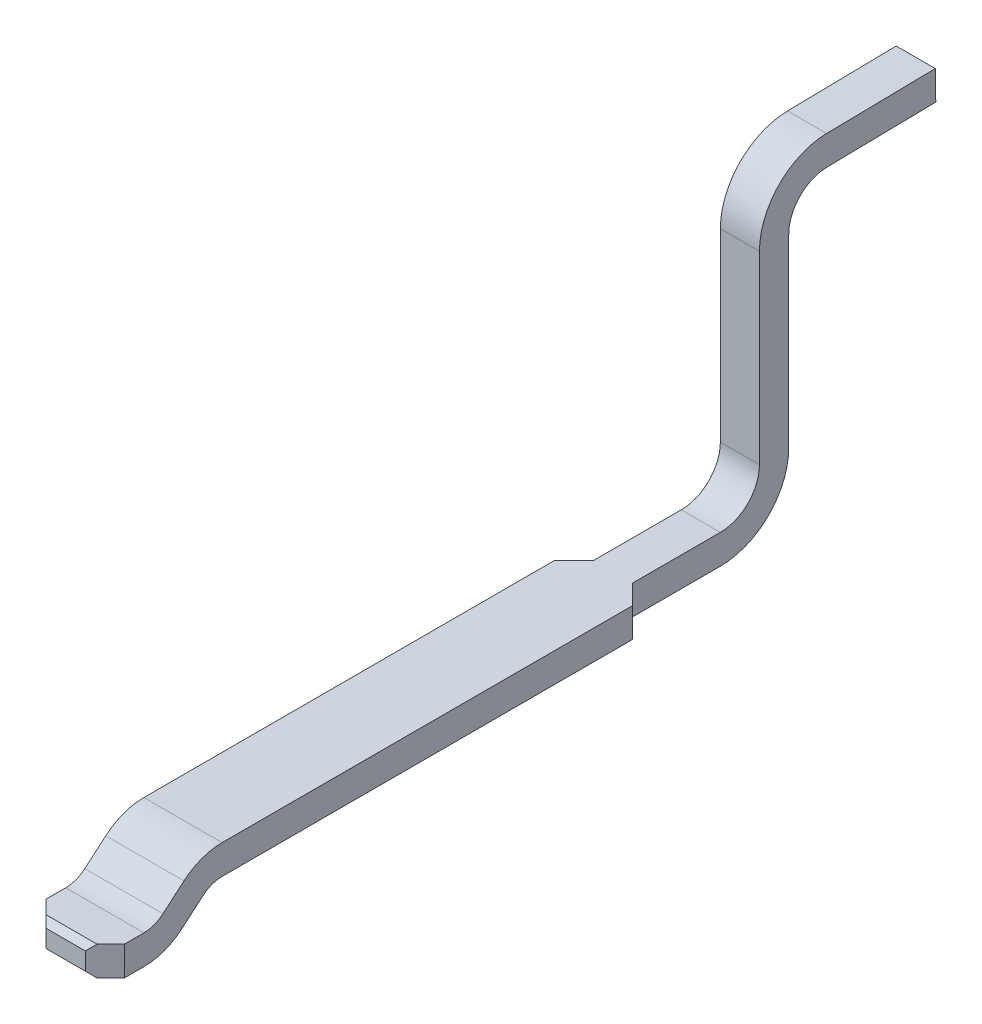
ISO-10303-21;
HEADER;
FILE_DESCRIPTION(('STEP AP214'),'2;1');
FILE_NAME('part.step','',(''),(''),'','','');
FILE_SCHEMA(('AUTOMOTIVE_DESIGN { 1 0 10303 214 1 1 1 1 }'));
ENDSEC;
DATA;
#1=APPLICATION_CONTEXT('core data for automotive mechanical design processes');
#2=APPLICATION_PROTOCOL_DEFINITION('international standard','automotive_design',2000,#1);
#3=PRODUCT_CONTEXT('',#1,'mechanical');
#4=PRODUCT('Part','Part','',(#3));
#5=PRODUCT_RELATED_PRODUCT_CATEGORY('part','',(#4));
#6=PRODUCT_DEFINITION_FORMATION('','',#4);
#7=PRODUCT_DEFINITION_CONTEXT('part definition',#1,'design');
#8=PRODUCT_DEFINITION('design','',#6,#7);
#9=PRODUCT_DEFINITION_SHAPE('','',#8);
#10=(LENGTH_UNIT() NAMED_UNIT(*) SI_UNIT(.MILLI.,.METRE.));
#11=(NAMED_UNIT(*) PLANE_ANGLE_UNIT() SI_UNIT($,.RADIAN.));
#12=(NAMED_UNIT(*) SI_UNIT($,.STERADIAN.) SOLID_ANGLE_UNIT());
#13=UNCERTAINTY_MEASURE_WITH_UNIT(LENGTH_MEASURE(1.E-05),#10,'distance_accuracy_value','');
#14=(GEOMETRIC_REPRESENTATION_CONTEXT(3) GLOBAL_UNCERTAINTY_ASSIGNED_CONTEXT((#13)) GLOBAL_UNIT_ASSIGNED_CONTEXT((#10,
#11,#12)) REPRESENTATION_CONTEXT('',''));
#15=CARTESIAN_POINT('',(0.,0.,0.));
#16=DIRECTION('',(0.,0.,1.));
#17=DIRECTION('',(1.,0.,0.));
#18=AXIS2_PLACEMENT_3D('',#15,#16,#17);
#19=CARTESIAN_POINT('',(-3.54596503503213,8.074228109921,4.324047830079));
#20=DIRECTION('',(0.,0.707106781186548,0.707106781186548));
#21=DIRECTION('',(0.,-0.707106781186548,0.707106781186548));
#22=AXIS2_PLACEMENT_3D('',#19,#20,#21);
#23=PLANE('',#22);
#24=DIRECTION('',(-0.577350269189631,0.577350269189615,-0.577350269189631));
#25=VECTOR('',#24,1.);
#26=CARTESIAN_POINT('',(-3.51026690000013,8.04019892,4.35807702));
#27=LINE('',#26,#25);
#28=CARTESIAN_POINT('',(-3.51026690000013,8.04019892,4.35807702));
#29=VERTEX_POINT('',#28);
#30=CARTESIAN_POINT('',(-3.54026690000013,8.07019892,4.32807702));
#31=VERTEX_POINT('',#30);
#32=EDGE_CURVE('E279',#29,#31,#27,.T.);
#33=ORIENTED_EDGE('',*,*,#32,.F.);
#34=DIRECTION('',(-1.,0.,0.));
#35=VECTOR('',#34,1.);
#36=CARTESIAN_POINT('',(-3.30456876496813,8.04019892,4.35807702));
#37=LINE('',#36,#35);
#38=CARTESIAN_POINT('',(-3.31026690000013,8.04019892,4.35807702));
#39=VERTEX_POINT('',#38);
#40=EDGE_CURVE('E356',#29,#39,#37,.F.);
#41=ORIENTED_EDGE('',*,*,#40,.T.);
#42=DIRECTION('',(-0.577350269189637,-0.577350269189604,0.577350269189637));
#43=VECTOR('',#42,1.);
#44=CARTESIAN_POINT('',(-3.28026690000013,8.07019892,4.32807702));
#45=LINE('',#44,#43);
#46=CARTESIAN_POINT('',(-3.28026690000013,8.07019892,4.32807702));
#47=VERTEX_POINT('',#46);
#48=EDGE_CURVE('E269',#47,#39,#45,.T.);
#49=ORIENTED_EDGE('',*,*,#48,.F.);
#50=DIRECTION('',(1.,0.,0.));
#51=VECTOR('',#50,1.);
#52=CARTESIAN_POINT('',(-3.20226690000013,8.07019892,4.32807702));
#53=LINE('',#52,#51);
#54=EDGE_CURVE('E276',#31,#47,#53,.T.);
#55=ORIENTED_EDGE('',*,*,#54,.F.);
#56=EDGE_LOOP('',(#33,#41,#49,#55));
#57=FACE_BOUND('',#56,.T.);
#58=ADVANCED_FACE('F17',(#57),#23,.T.);
#59=CARTESIAN_POINT('',(-3.30456876496813,7.944500784968,4.35807702));
#60=DIRECTION('',(0.,0.,-1.));
#61=DIRECTION('',(-1.,0.,0.));
#62=AXIS2_PLACEMENT_3D('',#59,#60,#61);
#63=PLANE('',#62);
#64=DIRECTION('',(0.,1.,0.));
#65=VECTOR('',#64,1.);
#66=CARTESIAN_POINT('',(-3.31026690000013,7.914500784968,4.35807702));
#67=LINE('',#66,#65);
#68=CARTESIAN_POINT('',(-3.31026690000013,7.95019892,4.35807702));
#69=VERTEX_POINT('',#68);
#70=EDGE_CURVE('E256',#39,#69,#67,.F.);
#71=ORIENTED_EDGE('',*,*,#70,.F.);
#72=ORIENTED_EDGE('',*,*,#40,.F.);
#73=DIRECTION('',(0.,1.,0.));
#74=VECTOR('',#73,1.);
#75=CARTESIAN_POINT('',(-3.51026690000013,7.914500784968,4.35807702));
#76=LINE('',#75,#74);
#77=CARTESIAN_POINT('',(-3.51026690000013,7.95019892,4.35807702));
#78=VERTEX_POINT('',#77);
#79=EDGE_CURVE('E338',#78,#29,#76,.T.);
#80=ORIENTED_EDGE('',*,*,#79,.F.);
#81=DIRECTION('',(1.,0.,0.));
#82=VECTOR('',#81,1.);
#83=CARTESIAN_POINT('',(-3.27456876496813,7.95019892,4.35807702));
#84=LINE('',#83,#82);
#85=EDGE_CURVE('E331',#69,#78,#84,.F.);
#86=ORIENTED_EDGE('',*,*,#85,.F.);
#87=EDGE_LOOP('',(#71,#72,#80,#86));
#88=FACE_BOUND('',#87,.T.);
#89=ADVANCED_FACE('F775',(#88),#63,.F.);
#90=CARTESIAN_POINT('',(-3.27456876496813,7.916169730079,4.324047830079));
#91=DIRECTION('',(0.,-0.707106781186548,0.707106781186548));
#92=DIRECTION('',(0.,-0.707106781186548,-0.707106781186548));
#93=AXIS2_PLACEMENT_3D('',#90,#91,#92);
#94=PLANE('',#93);
#95=DIRECTION('',(0.577350269189626,-0.577350269189626,-0.577350269189626));
#96=VECTOR('',#95,1.);
#97=CARTESIAN_POINT('',(-3.31026690000013,7.95019892,4.35807702));
#98=LINE('',#97,#96);
#99=CARTESIAN_POINT('',(-3.28026690000013,7.92019892,4.32807702));
#100=VERTEX_POINT('',#99);
#101=EDGE_CURVE('E270',#69,#100,#98,.T.);
#102=ORIENTED_EDGE('',*,*,#101,.F.);
#103=ORIENTED_EDGE('',*,*,#85,.T.);
#104=DIRECTION('',(0.57735026918962,0.577350269189637,0.57735026918962));
#105=VECTOR('',#104,1.);
#106=CARTESIAN_POINT('',(-3.54026690000013,7.92019892,4.32807702));
#107=LINE('',#106,#105);
#108=CARTESIAN_POINT('',(-3.54026690000013,7.92019892,4.32807702));
#109=VERTEX_POINT('',#108);
#110=EDGE_CURVE('E309',#109,#78,#107,.T.);
#111=ORIENTED_EDGE('',*,*,#110,.F.);
#112=DIRECTION('',(1.,0.,0.));
#113=VECTOR('',#112,1.);
#114=CARTESIAN_POINT('',(-3.20226690000013,7.92019892,4.32807702));
#115=LINE('',#114,#113);
#116=EDGE_CURVE('E252',#109,#100,#115,.T.);
#117=ORIENTED_EDGE('',*,*,#116,.T.);
#118=EDGE_LOOP('',(#102,#103,#111,#117));
#119=FACE_BOUND('',#118,.T.);
#120=ADVANCED_FACE('F768',(#119),#94,.T.);
#121=CARTESIAN_POINT('',(-3.30456876496813,8.45127780084181,0.758077020000001));
#122=DIRECTION('',(0.,0.,-1.));
#123=DIRECTION('',(-1.,0.,0.));
#124=AXIS2_PLACEMENT_3D('',#121,#122,#123);
#125=PLANE('',#124);
#126=DIRECTION('',(0.,1.,0.));
#127=VECTOR('',#126,1.);
#128=CARTESIAN_POINT('',(-3.31026690000013,9.610333059471,0.758077020000001));
#129=LINE('',#128,#127);
#130=CARTESIAN_POINT('',(-3.31026690000013,8.47019892,0.758077020000001));
#131=VERTEX_POINT('',#130);
#132=CARTESIAN_POINT('',(-3.31026690000013,9.41625487791,0.758077020000001));
#133=VERTEX_POINT('',#132);
#134=EDGE_CURVE('E416',#131,#133,#129,.T.);
#135=ORIENTED_EDGE('',*,*,#134,.F.);
#136=DIRECTION('',(-1.,0.,0.));
#137=VECTOR('',#136,1.);
#138=CARTESIAN_POINT('',(-3.31026690000013,8.47019892,0.75807702));
#139=LINE('',#138,#137);
#140=CARTESIAN_POINT('',(-3.51026690000013,8.47019892,0.758077020000001));
#141=VERTEX_POINT('',#140);
#142=EDGE_CURVE('E213',#141,#131,#139,.F.);
#143=ORIENTED_EDGE('',*,*,#142,.F.);
#144=DIRECTION('',(0.,1.,0.));
#145=VECTOR('',#144,1.);
#146=CARTESIAN_POINT('',(-3.51026690000013,8.45127780084181,0.758077020000001));
#147=LINE('',#146,#145);
#148=CARTESIAN_POINT('',(-3.51026690000013,9.41625487791,0.758077020000001));
#149=VERTEX_POINT('',#148);
#150=EDGE_CURVE('E412',#149,#141,#147,.F.);
#151=ORIENTED_EDGE('',*,*,#150,.F.);
#152=DIRECTION('',(1.,0.,0.));
#153=VECTOR('',#152,1.);
#154=CARTESIAN_POINT('',(-3.51026690000013,9.41625487791,0.758077020000001));
#155=LINE('',#154,#153);
#156=EDGE_CURVE('E306',#149,#133,#155,.T.);
#157=ORIENTED_EDGE('',*,*,#156,.T.);
#158=EDGE_LOOP('',(#135,#143,#151,#157));
#159=FACE_BOUND('',#158,.T.);
#160=ADVANCED_FACE('F579',(#159),#125,.T.);
#161=CARTESIAN_POINT('',(-3.31026690000013,8.47019892,1.10807702));
#162=DIRECTION('',(-1.,0.,0.));
#163=DIRECTION('',(0.,0.,1.));
#164=AXIS2_PLACEMENT_3D('',#161,#162,#163);
#165=CYLINDRICAL_SURFACE('',#164,0.35);
#166=DIRECTION('',(1.,0.,0.));
#167=VECTOR('',#166,1.);
#168=CARTESIAN_POINT('',(-3.20226690000013,8.12019892,1.10807702));
#169=LINE('',#168,#167);
#170=CARTESIAN_POINT('',(-3.31026690000013,8.12019892,1.10807702));
#171=VERTEX_POINT('',#170);
#172=CARTESIAN_POINT('',(-3.51026690000013,8.12019892,1.10807702));
#173=VERTEX_POINT('',#172);
#174=EDGE_CURVE('E229',#171,#173,#169,.F.);
#175=ORIENTED_EDGE('',*,*,#174,.T.);
#176=CARTESIAN_POINT('',(-3.51026690000013,8.47019892,1.10807702));
#177=DIRECTION('',(-1.,0.,0.));
#178=DIRECTION('',(0.,0.,1.));
#179=AXIS2_PLACEMENT_3D('',#176,#177,#178);
#180=CIRCLE('',#179,0.35);
#181=EDGE_CURVE('E409',#141,#173,#180,.T.);
#182=ORIENTED_EDGE('',*,*,#181,.F.);
#183=ORIENTED_EDGE('',*,*,#142,.T.);
#184=CARTESIAN_POINT('',(-3.31026690000013,8.47019892,1.10807702));
#185=DIRECTION('',(-1.,0.,0.));
#186=DIRECTION('',(0.,0.,1.));
#187=AXIS2_PLACEMENT_3D('',#184,#185,#186);
#188=CIRCLE('',#187,0.35);
#189=EDGE_CURVE('E417',#171,#131,#188,.F.);
#190=ORIENTED_EDGE('',*,*,#189,.F.);
#191=EDGE_LOOP('',(#175,#182,#183,#190));
#192=FACE_BOUND('',#191,.T.);
#193=ADVANCED_FACE('F576',(#192),#165,.T.);
#194=CARTESIAN_POINT('',(-3.30456876496813,8.45127780084181,0.908077020000001));
#195=DIRECTION('',(0.,0.,-1.));
#196=DIRECTION('',(-1.,0.,0.));
#197=AXIS2_PLACEMENT_3D('',#194,#195,#196);
#198=PLANE('',#197);
#199=DIRECTION('',(-1.,0.,0.));
#200=VECTOR('',#199,1.);
#201=CARTESIAN_POINT('',(-3.31026690000013,8.47019892,0.90807702));
#202=LINE('',#201,#200);
#203=CARTESIAN_POINT('',(-3.51026690000013,8.47019892,0.908077020000001));
#204=VERTEX_POINT('',#203);
#205=CARTESIAN_POINT('',(-3.31026690000013,8.47019892,0.908077020000001));
#206=VERTEX_POINT('',#205);
#207=EDGE_CURVE('E218',#204,#206,#202,.F.);
#208=ORIENTED_EDGE('',*,*,#207,.T.);
#209=DIRECTION('',(0.,1.,0.));
#210=VECTOR('',#209,1.);
#211=CARTESIAN_POINT('',(-3.31026690000013,9.610333059471,0.908077020000001));
#212=LINE('',#211,#210);
#213=CARTESIAN_POINT('',(-3.31026690000013,9.41625487791,0.908077020000001));
#214=VERTEX_POINT('',#213);
#215=EDGE_CURVE('E216',#214,#206,#212,.F.);
#216=ORIENTED_EDGE('',*,*,#215,.F.);
#217=DIRECTION('',(1.,0.,0.));
#218=VECTOR('',#217,1.);
#219=CARTESIAN_POINT('',(-3.51026690000013,9.41625487791,0.908077020000001));
#220=LINE('',#219,#218);
#221=CARTESIAN_POINT('',(-3.51026690000013,9.41625487791,0.908077020000001));
#222=VERTEX_POINT('',#221);
#223=EDGE_CURVE('E203',#222,#214,#220,.T.);
#224=ORIENTED_EDGE('',*,*,#223,.F.);
#225=DIRECTION('',(0.,1.,0.));
#226=VECTOR('',#225,1.);
#227=CARTESIAN_POINT('',(-3.51026690000013,8.45127780084181,0.908077020000001));
#228=LINE('',#227,#226);
#229=EDGE_CURVE('E404',#204,#222,#228,.T.);
#230=ORIENTED_EDGE('',*,*,#229,.F.);
#231=EDGE_LOOP('',(#208,#216,#224,#230));
#232=FACE_BOUND('',#231,.T.);
#233=ADVANCED_FACE('F217',(#232),#198,.F.);
#234=CARTESIAN_POINT('',(-3.51026690000013,9.41625487791,0.558077020000001));
#235=DIRECTION('',(1.,0.,0.));
#236=DIRECTION('',(0.,0.,-1.));
#237=AXIS2_PLACEMENT_3D('',#234,#235,#236);
#238=CYLINDRICAL_SURFACE('',#237,0.35);
#239=ORIENTED_EDGE('',*,*,#223,.T.);
#240=CARTESIAN_POINT('',(-3.31026690000013,9.41625487791,0.558077020000001));
#241=DIRECTION('',(1.,0.,0.));
#242=DIRECTION('',(0.,0.,-1.));
#243=AXIS2_PLACEMENT_3D('',#240,#241,#242);
#244=CIRCLE('',#243,0.35);
#245=CARTESIAN_POINT('',(-3.31026690000013,9.76620157121429,0.564185362253241));
#246=VERTEX_POINT('',#245);
#247=EDGE_CURVE('E20',#246,#214,#244,.T.);
#248=ORIENTED_EDGE('',*,*,#247,.F.);
#249=DIRECTION('',(1.,0.,0.));
#250=VECTOR('',#249,1.);
#251=CARTESIAN_POINT('',(-3.51596503503213,9.76620157121458,0.564185362253011));
#252=LINE('',#251,#250);
#253=CARTESIAN_POINT('',(-3.51026690000013,9.76620157121429,0.564185362253241));
#254=VERTEX_POINT('',#253);
#255=EDGE_CURVE('E198',#254,#246,#252,.T.);
#256=ORIENTED_EDGE('',*,*,#255,.F.);
#257=CARTESIAN_POINT('',(-3.51026690000013,9.41625487791,0.558077020000001));
#258=DIRECTION('',(1.,0.,0.));
#259=DIRECTION('',(0.,0.,-1.));
#260=AXIS2_PLACEMENT_3D('',#257,#258,#259);
#261=CIRCLE('',#260,0.35);
#262=EDGE_CURVE('E209',#222,#254,#261,.F.);
#263=ORIENTED_EDGE('',*,*,#262,.F.);
#264=EDGE_LOOP('',(#239,#248,#256,#263));
#265=FACE_BOUND('',#264,.T.);
#266=ADVANCED_FACE('F205',(#265),#238,.T.);
#267=CARTESIAN_POINT('',(-3.51596503503213,9.766007480923,0.575304787611001));
#268=DIRECTION('',(0.,0.999847695156406,0.0174524064364471));
#269=DIRECTION('',(0.,-0.0174524064364471,0.999847695156406));
#270=AXIS2_PLACEMENT_3D('',#267,#268,#269);
#271=PLANE('',#270);
#272=DIRECTION('',(0.,0.0174524064385203,-0.99984769515637));
#273=VECTOR('',#272,1.);
#274=CARTESIAN_POINT('',(-3.51026690000013,9.766201571214,0.564185362253001));
#275=LINE('',#274,#273);
#276=CARTESIAN_POINT('',(-3.51026690000013,9.775906085794,0.00821409435916126));
#277=VERTEX_POINT('',#276);
#278=EDGE_CURVE('E318',#254,#277,#275,.T.);
#279=ORIENTED_EDGE('',*,*,#278,.F.);
#280=ORIENTED_EDGE('',*,*,#255,.T.);
#281=DIRECTION('',(0.,-0.0174524064385203,0.99984769515637));
#282=VECTOR('',#281,1.);
#283=CARTESIAN_POINT('',(-3.31026690000013,9.775906085794,0.00821409435900074));
#284=LINE('',#283,#282);
#285=CARTESIAN_POINT('',(-3.31026690000013,9.775906085794,0.00821409435916126));
#286=VERTEX_POINT('',#285);
#287=EDGE_CURVE('E226',#286,#246,#284,.T.);
#288=ORIENTED_EDGE('',*,*,#287,.F.);
#289=DIRECTION('',(1.,0.,0.));
#290=VECTOR('',#289,1.);
#291=CARTESIAN_POINT('',(-3.30456876496813,9.77590608579399,0.0082140943594823));
#292=LINE('',#291,#290);
#293=EDGE_CURVE('E311',#277,#286,#292,.T.);
#294=ORIENTED_EDGE('',*,*,#293,.F.);
#295=EDGE_LOOP('',(#279,#280,#288,#294));
#296=FACE_BOUND('',#295,.T.);
#297=ADVANCED_FACE('F593',(#296),#271,.T.);
#298=CARTESIAN_POINT('',(-3.30456876496813,9.620231664342,0.00549678722500089));
#299=DIRECTION('',(0.,0.0174524064396861,-0.999847695156349));
#300=DIRECTION('',(0.,0.999847695156349,0.0174524064396861));
#301=AXIS2_PLACEMENT_3D('',#298,#299,#300);
#302=PLANE('',#301);
#303=DIRECTION('',(1.,0.,0.));
#304=VECTOR('',#303,1.);
#305=CARTESIAN_POINT('',(-3.51596503503213,9.62592893152041,0.00559623339400797));
#306=LINE('',#305,#304);
#307=CARTESIAN_POINT('',(-3.31026690000013,9.62592893152018,0.00559623339400417));
#308=VERTEX_POINT('',#307);
#309=CARTESIAN_POINT('',(-3.51026690000013,9.62592893152014,0.00559623339400334));
#310=VERTEX_POINT('',#309);
#311=EDGE_CURVE('E307',#308,#310,#306,.F.);
#312=ORIENTED_EDGE('',*,*,#311,.T.);
#313=DIRECTION('',(0.,-0.999847695156461,-0.0174524064332696));
#314=VECTOR('',#313,1.);
#315=CARTESIAN_POINT('',(-3.51026690000013,9.775906085794,0.00821409435900074));
#316=LINE('',#315,#314);
#317=EDGE_CURVE('E314',#277,#310,#316,.T.);
#318=ORIENTED_EDGE('',*,*,#317,.F.);
#319=ORIENTED_EDGE('',*,*,#293,.T.);
#320=DIRECTION('',(0.,0.999847695156461,0.0174524064332696));
#321=VECTOR('',#320,1.);
#322=CARTESIAN_POINT('',(-3.31026690000013,9.62592893152,0.00559623339400103));
#323=LINE('',#322,#321);
#324=EDGE_CURVE('E328',#308,#286,#323,.T.);
#325=ORIENTED_EDGE('',*,*,#324,.F.);
#326=EDGE_LOOP('',(#312,#318,#319,#325));
#327=FACE_BOUND('',#326,.T.);
#328=ADVANCED_FACE('F592',(#327),#302,.T.);
#329=CARTESIAN_POINT('',(-3.51596503503213,9.616030326649,0.572686926645001));
#330=DIRECTION('',(0.,0.999847695156375,0.0174524064382066));
#331=DIRECTION('',(0.,-0.0174524064382066,0.999847695156375));
#332=AXIS2_PLACEMENT_3D('',#329,#330,#331);
#333=PLANE('',#332);
#334=DIRECTION('',(1.,0.,0.));
#335=VECTOR('',#334,1.);
#336=CARTESIAN_POINT('',(-3.51026690000013,9.61622441694128,0.561567501287006));
#337=LINE('',#336,#335);
#338=CARTESIAN_POINT('',(-3.31026690000013,9.61622441694114,0.561567501287176));
#339=VERTEX_POINT('',#338);
#340=CARTESIAN_POINT('',(-3.51026690000013,9.61622441694114,0.561567501287176));
#341=VERTEX_POINT('',#340);
#342=EDGE_CURVE('E304',#339,#341,#337,.F.);
#343=ORIENTED_EDGE('',*,*,#342,.T.);
#344=DIRECTION('',(0.,-0.0174524064367521,0.999847695156401));
#345=VECTOR('',#344,1.);
#346=CARTESIAN_POINT('',(-3.51026690000013,9.62592893152,0.00559623339400103));
#347=LINE('',#346,#345);
#348=EDGE_CURVE('E317',#310,#341,#347,.T.);
#349=ORIENTED_EDGE('',*,*,#348,.F.);
#350=ORIENTED_EDGE('',*,*,#311,.F.);
#351=DIRECTION('',(0.,0.0174524064367521,-0.999847695156401));
#352=VECTOR('',#351,1.);
#353=CARTESIAN_POINT('',(-3.31026690000013,9.616224416941,0.561567501287001));
#354=LINE('',#353,#352);
#355=EDGE_CURVE('E333',#339,#308,#354,.T.);
#356=ORIENTED_EDGE('',*,*,#355,.F.);
#357=EDGE_LOOP('',(#343,#349,#350,#356));
#358=FACE_BOUND('',#357,.T.);
#359=ADVANCED_FACE('F588',(#358),#333,.F.);
#360=CARTESIAN_POINT('',(-3.51026690000013,9.41625487791,0.558077020000001));
#361=DIRECTION('',(1.,0.,0.));
#362=DIRECTION('',(0.,0.,-1.));
#363=AXIS2_PLACEMENT_3D('',#360,#361,#362);
#364=CYLINDRICAL_SURFACE('',#363,0.2);
#365=ORIENTED_EDGE('',*,*,#156,.F.);
#366=CARTESIAN_POINT('',(-3.51026690000013,9.41625487791,0.558077020000001));
#367=DIRECTION('',(1.,0.,0.));
#368=DIRECTION('',(0.,0.,-1.));
#369=AXIS2_PLACEMENT_3D('',#366,#367,#368);
#370=CIRCLE('',#369,0.2);
#371=EDGE_CURVE('E400',#341,#149,#370,.T.);
#372=ORIENTED_EDGE('',*,*,#371,.F.);
#373=ORIENTED_EDGE('',*,*,#342,.F.);
#374=CARTESIAN_POINT('',(-3.31026690000013,9.41625487791,0.558077020000001));
#375=DIRECTION('',(1.,0.,0.));
#376=DIRECTION('',(0.,0.,-1.));
#377=AXIS2_PLACEMENT_3D('',#374,#375,#376);
#378=CIRCLE('',#377,0.2);
#379=EDGE_CURVE('E414',#133,#339,#378,.F.);
#380=ORIENTED_EDGE('',*,*,#379,.F.);
#381=EDGE_LOOP('',(#365,#372,#373,#380));
#382=FACE_BOUND('',#381,.T.);
#383=ADVANCED_FACE('F584',(#382),#364,.F.);
#384=CARTESIAN_POINT('',(-3.61429608992113,7.914500784968,4.254047830079));
#385=DIRECTION('',(-0.707106781186548,0.,0.707106781186548));
#386=DIRECTION('',(0.707106781186548,0.,0.707106781186548));
#387=AXIS2_PLACEMENT_3D('',#384,#385,#386);
#388=PLANE('',#387);
#389=DIRECTION('',(0.,1.,0.));
#390=VECTOR('',#389,1.);
#391=CARTESIAN_POINT('',(-3.61026690000013,7.914500784968,4.25807702));
#392=LINE('',#391,#390);
#393=CARTESIAN_POINT('',(-3.61026690000013,8.07019892,4.25807702));
#394=VERTEX_POINT('',#393);
#395=CARTESIAN_POINT('',(-3.61026690000013,7.92019892,4.25807702));
#396=VERTEX_POINT('',#395);
#397=EDGE_CURVE('E295',#394,#396,#392,.F.);
#398=ORIENTED_EDGE('',*,*,#397,.T.);
#399=DIRECTION('',(0.707106781186548,0.,0.707106781186548));
#400=VECTOR('',#399,1.);
#401=CARTESIAN_POINT('',(-3.61026690000013,7.92019892,4.25807702));
#402=LINE('',#401,#400);
#403=EDGE_CURVE('E255',#396,#109,#402,.T.);
#404=ORIENTED_EDGE('',*,*,#403,.T.);
#405=ORIENTED_EDGE('',*,*,#110,.T.);
#406=ORIENTED_EDGE('',*,*,#79,.T.);
#407=ORIENTED_EDGE('',*,*,#32,.T.);
#408=DIRECTION('',(0.707106781186548,0.,0.707106781186548));
#409=VECTOR('',#408,1.);
#410=CARTESIAN_POINT('',(-3.61026690000013,8.07019892,4.25807702));
#411=LINE('',#410,#409);
#412=EDGE_CURVE('E275',#394,#31,#411,.T.);
#413=ORIENTED_EDGE('',*,*,#412,.F.);
#414=EDGE_LOOP('',(#398,#404,#405,#406,#407,#413));
#415=FACE_BOUND('',#414,.T.);
#416=ADVANCED_FACE('F712',(#415),#388,.T.);
#417=CARTESIAN_POINT('',(-3.20226690000013,8.102515836027,4.064893542443));
#418=DIRECTION('',(0.,0.759858617954068,0.650088363779058));
#419=DIRECTION('',(0.,-0.650088363779058,0.759858617954068));
#420=AXIS2_PLACEMENT_3D('',#417,#418,#419);
#421=PLANE('',#420);
#422=DIRECTION('',(0.,-0.650088363774947,0.759858617957586));
#423=VECTOR('',#422,1.);
#424=CARTESIAN_POINT('',(-3.61026690000013,8.198156505386,3.953103529133));
#425=LINE('',#424,#423);
#426=CARTESIAN_POINT('',(-3.61026690000013,8.19815650538664,3.95310352913274));
#427=VERTEX_POINT('',#426);
#428=CARTESIAN_POINT('',(-3.61026690000013,8.10622012730668,4.06056376543338));
#429=VERTEX_POINT('',#428);
#430=EDGE_CURVE('E393',#427,#429,#425,.T.);
#431=ORIENTED_EDGE('',*,*,#430,.T.);
#432=DIRECTION('',(-1.,0.,0.));
#433=VECTOR('',#432,1.);
#434=CARTESIAN_POINT('',(-3.21026690000013,8.10622012730701,4.06056376543301));
#435=LINE('',#434,#433);
#436=CARTESIAN_POINT('',(-3.21026690000013,8.10622012730668,4.06056376543338));
#437=VERTEX_POINT('',#436);
#438=EDGE_CURVE('E277',#429,#437,#435,.F.);
#439=ORIENTED_EDGE('',*,*,#438,.T.);
#440=DIRECTION('',(0.,-0.650088363774947,0.759858617957586));
#441=VECTOR('',#440,1.);
#442=CARTESIAN_POINT('',(-3.21026690000013,8.198156505386,3.953103529133));
#443=LINE('',#442,#441);
#444=CARTESIAN_POINT('',(-3.21026690000013,8.19815650538664,3.95310352913274));
#445=VERTEX_POINT('',#444);
#446=EDGE_CURVE('E385',#445,#437,#443,.T.);
#447=ORIENTED_EDGE('',*,*,#446,.F.);
#448=DIRECTION('',(-1.,0.,0.));
#449=VECTOR('',#448,1.);
#450=CARTESIAN_POINT('',(-3.21026690000013,8.19815650538648,3.95310352913341));
#451=LINE('',#450,#449);
#452=EDGE_CURVE('E280',#427,#445,#451,.F.);
#453=ORIENTED_EDGE('',*,*,#452,.F.);
#454=EDGE_LOOP('',(#431,#439,#447,#453));
#455=FACE_BOUND('',#454,.T.);
#456=ADVANCED_FACE('F528',(#455),#421,.T.);
#457=CARTESIAN_POINT('',(-3.21026690000013,8.22019892,4.15807702));
#458=DIRECTION('',(-1.,0.,0.));
#459=DIRECTION('',(0.,0.,1.));
#460=AXIS2_PLACEMENT_3D('',#457,#458,#459);
#461=CYLINDRICAL_SURFACE('',#460,0.15);
#462=CARTESIAN_POINT('',(-3.61026690000013,8.22019892,4.15807702));
#463=DIRECTION('',(-1.,0.,0.));
#464=DIRECTION('',(0.,0.,1.));
#465=AXIS2_PLACEMENT_3D('',#462,#463,#464);
#466=CIRCLE('',#465,0.15);
#467=CARTESIAN_POINT('',(-3.61026690000013,8.07019892,4.15807702));
#468=VERTEX_POINT('',#467);
#469=EDGE_CURVE('E390',#429,#468,#466,.T.);
#470=ORIENTED_EDGE('',*,*,#469,.T.);
#471=DIRECTION('',(1.,0.,0.));
#472=VECTOR('',#471,1.);
#473=CARTESIAN_POINT('',(-3.20226690000013,8.07019892,4.15807702));
#474=LINE('',#473,#472);
#475=CARTESIAN_POINT('',(-3.21026690000013,8.07019892,4.15807702));
#476=VERTEX_POINT('',#475);
#477=EDGE_CURVE('E273',#476,#468,#474,.F.);
#478=ORIENTED_EDGE('',*,*,#477,.F.);
#479=CARTESIAN_POINT('',(-3.21026690000013,8.22019892,4.15807702));
#480=DIRECTION('',(-1.,0.,0.));
#481=DIRECTION('',(0.,0.,1.));
#482=AXIS2_PLACEMENT_3D('',#479,#480,#481);
#483=CIRCLE('',#482,0.15);
#484=EDGE_CURVE('E382',#437,#476,#483,.T.);
#485=ORIENTED_EDGE('',*,*,#484,.F.);
#486=ORIENTED_EDGE('',*,*,#438,.F.);
#487=EDGE_LOOP('',(#470,#478,#485,#486));
#488=FACE_BOUND('',#487,.T.);
#489=ADVANCED_FACE('F533',(#488),#461,.F.);
#490=CARTESIAN_POINT('',(-3.20226690000013,8.07019892,4.333775155032));
#491=DIRECTION('',(0.,1.,0.));
#492=DIRECTION('',(0.,0.,1.));
#493=AXIS2_PLACEMENT_3D('',#490,#491,#492);
#494=PLANE('',#493);
#495=DIRECTION('',(0.,0.,-1.));
#496=VECTOR('',#495,1.);
#497=CARTESIAN_POINT('',(-3.61026690000013,8.07019892,4.163775155032));
#498=LINE('',#497,#496);
#499=EDGE_CURVE('E287',#468,#394,#498,.F.);
#500=ORIENTED_EDGE('',*,*,#499,.T.);
#501=ORIENTED_EDGE('',*,*,#412,.T.);
#502=ORIENTED_EDGE('',*,*,#54,.T.);
#503=DIRECTION('',(0.707106781186548,0.,-0.707106781186548));
#504=VECTOR('',#503,1.);
#505=CARTESIAN_POINT('',(-3.31429608992113,8.07019892,4.362106209921));
#506=LINE('',#505,#504);
#507=CARTESIAN_POINT('',(-3.21026690000013,8.07019892,4.25807702));
#508=VERTEX_POINT('',#507);
#509=EDGE_CURVE('E266',#508,#47,#506,.F.);
#510=ORIENTED_EDGE('',*,*,#509,.F.);
#511=DIRECTION('',(0.,0.,-1.));
#512=VECTOR('',#511,1.);
#513=CARTESIAN_POINT('',(-3.21026690000013,8.07019892,3.80007702));
#514=LINE('',#513,#512);
#515=EDGE_CURVE('E263',#476,#508,#514,.F.);
#516=ORIENTED_EDGE('',*,*,#515,.F.);
#517=ORIENTED_EDGE('',*,*,#477,.T.);
#518=EDGE_LOOP('',(#500,#501,#502,#510,#516,#517));
#519=FACE_BOUND('',#518,.T.);
#520=ADVANCED_FACE('F537',(#519),#494,.T.);
#521=CARTESIAN_POINT('',(-3.31429608992113,7.914500784968,4.362106209921));
#522=DIRECTION('',(0.707106781186548,0.,0.707106781186548));
#523=DIRECTION('',(0.707106781186548,0.,-0.707106781186548));
#524=AXIS2_PLACEMENT_3D('',#521,#522,#523);
#525=PLANE('',#524);
#526=ORIENTED_EDGE('',*,*,#48,.T.);
#527=ORIENTED_EDGE('',*,*,#70,.T.);
#528=ORIENTED_EDGE('',*,*,#101,.T.);
#529=DIRECTION('',(0.707106781186545,0.,-0.70710678118655));
#530=VECTOR('',#529,1.);
#531=CARTESIAN_POINT('',(-3.28026690000013,7.92019892,4.32807702));
#532=LINE('',#531,#530);
#533=CARTESIAN_POINT('',(-3.21026690000013,7.92019892,4.25807702));
#534=VERTEX_POINT('',#533);
#535=EDGE_CURVE('E253',#100,#534,#532,.T.);
#536=ORIENTED_EDGE('',*,*,#535,.T.);
#537=DIRECTION('',(0.,1.,0.));
#538=VECTOR('',#537,1.);
#539=CARTESIAN_POINT('',(-3.21026690000013,8.114500784968,4.25807702));
#540=LINE('',#539,#538);
#541=EDGE_CURVE('E259',#508,#534,#540,.F.);
#542=ORIENTED_EDGE('',*,*,#541,.F.);
#543=ORIENTED_EDGE('',*,*,#509,.T.);
#544=EDGE_LOOP('',(#526,#527,#528,#536,#542,#543));
#545=FACE_BOUND('',#544,.T.);
#546=ADVANCED_FACE('F540',(#545),#525,.T.);
#547=CARTESIAN_POINT('',(-3.20226690000013,7.92019892,4.333775155032));
#548=DIRECTION('',(0.,1.,0.));
#549=DIRECTION('',(0.,0.,1.));
#550=AXIS2_PLACEMENT_3D('',#547,#548,#549);
#551=PLANE('',#550);
#552=ORIENTED_EDGE('',*,*,#403,.F.);
#553=DIRECTION('',(0.,0.,-1.));
#554=VECTOR('',#553,1.);
#555=CARTESIAN_POINT('',(-3.61026690000013,7.92019892,4.163775155032));
#556=LINE('',#555,#554);
#557=CARTESIAN_POINT('',(-3.61026690000013,7.92019892,4.15807702));
#558=VERTEX_POINT('',#557);
#559=EDGE_CURVE('E297',#396,#558,#556,.T.);
#560=ORIENTED_EDGE('',*,*,#559,.T.);
#561=DIRECTION('',(-1.,0.,0.));
#562=VECTOR('',#561,1.);
#563=CARTESIAN_POINT('',(-3.21026690000013,7.92019892,4.15807702));
#564=LINE('',#563,#562);
#565=CARTESIAN_POINT('',(-3.21026690000013,7.92019892,4.15807702));
#566=VERTEX_POINT('',#565);
#567=EDGE_CURVE('E249',#566,#558,#564,.T.);
#568=ORIENTED_EDGE('',*,*,#567,.F.);
#569=DIRECTION('',(0.,0.,-1.));
#570=VECTOR('',#569,1.);
#571=CARTESIAN_POINT('',(-3.21026690000013,7.92019892,3.80007702));
#572=LINE('',#571,#570);
#573=EDGE_CURVE('E262',#534,#566,#572,.T.);
#574=ORIENTED_EDGE('',*,*,#573,.F.);
#575=ORIENTED_EDGE('',*,*,#535,.F.);
#576=ORIENTED_EDGE('',*,*,#116,.F.);
#577=EDGE_LOOP('',(#552,#560,#568,#574,#575,#576));
#578=FACE_BOUND('',#577,.T.);
#579=ADVANCED_FACE('F547',(#578),#551,.F.);
#580=CARTESIAN_POINT('',(-3.21026690000013,8.22019892,4.15807702));
#581=DIRECTION('',(-1.,0.,0.));
#582=DIRECTION('',(0.,0.,1.));
#583=AXIS2_PLACEMENT_3D('',#580,#581,#582);
#584=CYLINDRICAL_SURFACE('',#583,0.3);
#585=CARTESIAN_POINT('',(-3.61026690000013,8.22019892,4.15807702));
#586=DIRECTION('',(-1.,0.,0.));
#587=DIRECTION('',(0.,0.,1.));
#588=AXIS2_PLACEMENT_3D('',#585,#586,#587);
#589=CIRCLE('',#588,0.3);
#590=CARTESIAN_POINT('',(-3.61026690000013,7.99224133461339,3.96305051086728));
#591=VERTEX_POINT('',#590);
#592=EDGE_CURVE('E398',#558,#591,#589,.F.);
#593=ORIENTED_EDGE('',*,*,#592,.T.);
#594=DIRECTION('',(1.,0.,0.));
#595=VECTOR('',#594,1.);
#596=CARTESIAN_POINT('',(-3.20226690000013,7.99224133461357,3.96305051086664));
#597=LINE('',#596,#595);
#598=CARTESIAN_POINT('',(-3.21026690000013,7.99224133461339,3.96305051086728));
#599=VERTEX_POINT('',#598);
#600=EDGE_CURVE('E247',#591,#599,#597,.T.);
#601=ORIENTED_EDGE('',*,*,#600,.T.);
#602=CARTESIAN_POINT('',(-3.21026690000013,8.22019892,4.15807702));
#603=DIRECTION('',(-1.,0.,0.));
#604=DIRECTION('',(0.,0.,1.));
#605=AXIS2_PLACEMENT_3D('',#602,#603,#604);
#606=CIRCLE('',#605,0.3);
#607=EDGE_CURVE('E379',#566,#599,#606,.F.);
#608=ORIENTED_EDGE('',*,*,#607,.F.);
#609=ORIENTED_EDGE('',*,*,#567,.T.);
#610=EDGE_LOOP('',(#593,#601,#608,#609));
#611=FACE_BOUND('',#610,.T.);
#612=ADVANCED_FACE('F551',(#611),#584,.T.);
#613=CARTESIAN_POINT('',(-3.20226690000013,7.988537043334,3.967380287877));
#614=DIRECTION('',(0.,0.759858617954068,0.650088363779058));
#615=DIRECTION('',(0.,-0.650088363779058,0.759858617954068));
#616=AXIS2_PLACEMENT_3D('',#613,#614,#615);
#617=PLANE('',#616);
#618=ORIENTED_EDGE('',*,*,#600,.F.);
#619=DIRECTION('',(0.,0.650088363774937,-0.759858617957595));
#620=VECTOR('',#619,1.);
#621=CARTESIAN_POINT('',(-3.61026690000013,7.992241334614,3.963050510867));
#622=LINE('',#621,#620);
#623=CARTESIAN_POINT('',(-3.61026690000013,8.08417771269332,3.85559027456662));
#624=VERTEX_POINT('',#623);
#625=EDGE_CURVE('E397',#591,#624,#622,.T.);
#626=ORIENTED_EDGE('',*,*,#625,.T.);
#627=DIRECTION('',(-1.,0.,0.));
#628=VECTOR('',#627,1.);
#629=CARTESIAN_POINT('',(-3.21026690000013,8.08417771269299,3.85559027456699));
#630=LINE('',#629,#628);
#631=CARTESIAN_POINT('',(-3.21026690000013,8.08417771269332,3.85559027456662));
#632=VERTEX_POINT('',#631);
#633=EDGE_CURVE('E243',#624,#632,#630,.F.);
#634=ORIENTED_EDGE('',*,*,#633,.T.);
#635=DIRECTION('',(0.,0.650088363774937,-0.759858617957595));
#636=VECTOR('',#635,1.);
#637=CARTESIAN_POINT('',(-3.21026690000013,7.992241334614,3.963050510867));
#638=LINE('',#637,#636);
#639=EDGE_CURVE('E378',#599,#632,#638,.T.);
#640=ORIENTED_EDGE('',*,*,#639,.F.);
#641=EDGE_LOOP('',(#618,#626,#634,#640));
#642=FACE_BOUND('',#641,.T.);
#643=ADVANCED_FACE('F556',(#642),#617,.F.);
#644=CARTESIAN_POINT('',(-3.21026690000013,7.97019892,3.75807702));
#645=DIRECTION('',(-1.,0.,0.));
#646=DIRECTION('',(0.,0.,1.));
#647=AXIS2_PLACEMENT_3D('',#644,#645,#646);
#648=CYLINDRICAL_SURFACE('',#647,0.15);
#649=CARTESIAN_POINT('',(-3.61026690000013,7.97019892,3.75807702));
#650=DIRECTION('',(-1.,0.,0.));
#651=DIRECTION('',(0.,0.,1.));
#652=AXIS2_PLACEMENT_3D('',#649,#650,#651);
#653=CIRCLE('',#652,0.15);
#654=CARTESIAN_POINT('',(-3.61026690000013,8.12019892,3.75807702));
#655=VERTEX_POINT('',#654);
#656=EDGE_CURVE('E394',#624,#655,#653,.T.);
#657=ORIENTED_EDGE('',*,*,#656,.T.);
#658=DIRECTION('',(1.,0.,0.));
#659=VECTOR('',#658,1.);
#660=CARTESIAN_POINT('',(-3.20226690000013,8.12019892,3.75807702));
#661=LINE('',#660,#659);
#662=CARTESIAN_POINT('',(-3.21026690000013,8.12019892,3.75807702));
#663=VERTEX_POINT('',#662);
#664=EDGE_CURVE('E227',#655,#663,#661,.T.);
#665=ORIENTED_EDGE('',*,*,#664,.T.);
#666=CARTESIAN_POINT('',(-3.21026690000013,7.97019892,3.75807702));
#667=DIRECTION('',(-1.,0.,0.));
#668=DIRECTION('',(0.,0.,1.));
#669=AXIS2_PLACEMENT_3D('',#666,#667,#668);
#670=CIRCLE('',#669,0.15);
#671=EDGE_CURVE('E374',#632,#663,#670,.T.);
#672=ORIENTED_EDGE('',*,*,#671,.F.);
#673=ORIENTED_EDGE('',*,*,#633,.F.);
#674=EDGE_LOOP('',(#657,#665,#672,#673));
#675=FACE_BOUND('',#674,.T.);
#676=ADVANCED_FACE('F560',(#675),#648,.F.);
#677=CARTESIAN_POINT('',(-3.20226690000013,8.12019892,3.81107702));
#678=DIRECTION('',(0.,1.,0.));
#679=DIRECTION('',(0.,0.,1.));
#680=AXIS2_PLACEMENT_3D('',#677,#678,#679);
#681=PLANE('',#680);
#682=ORIENTED_EDGE('',*,*,#664,.F.);
#683=DIRECTION('',(0.,0.,-1.));
#684=VECTOR('',#683,1.);
#685=CARTESIAN_POINT('',(-3.61026690000013,8.12019892,4.163775155032));
#686=LINE('',#685,#684);
#687=CARTESIAN_POINT('',(-3.61026690000013,8.12019892,1.65807702));
#688=VERTEX_POINT('',#687);
#689=EDGE_CURVE('E396',#655,#688,#686,.T.);
#690=ORIENTED_EDGE('',*,*,#689,.T.);
#691=DIRECTION('',(-0.707106781186548,0.,0.707106781186548));
#692=VECTOR('',#691,1.);
#693=CARTESIAN_POINT('',(-3.61429608992113,8.12019892,1.662106209921));
#694=LINE('',#693,#692);
#695=CARTESIAN_POINT('',(-3.51026690000013,8.12019892,1.55807702));
#696=VERTEX_POINT('',#695);
#697=EDGE_CURVE('E284',#696,#688,#694,.T.);
#698=ORIENTED_EDGE('',*,*,#697,.F.);
#699=DIRECTION('',(0.,0.,1.));
#700=VECTOR('',#699,1.);
#701=CARTESIAN_POINT('',(-3.51026690000013,8.12019892,0.913775155032));
#702=LINE('',#701,#700);
#703=EDGE_CURVE('E408',#173,#696,#702,.T.);
#704=ORIENTED_EDGE('',*,*,#703,.F.);
#705=ORIENTED_EDGE('',*,*,#174,.F.);
#706=DIRECTION('',(0.,0.,-1.));
#707=VECTOR('',#706,1.);
#708=CARTESIAN_POINT('',(-3.31026690000013,8.12019892,0.572587480477));
#709=LINE('',#708,#707);
#710=CARTESIAN_POINT('',(-3.31026690000013,8.12019892,1.55807702));
#711=VERTEX_POINT('',#710);
#712=EDGE_CURVE('E221',#711,#171,#709,.T.);
#713=ORIENTED_EDGE('',*,*,#712,.F.);
#714=DIRECTION('',(-0.707106781186549,0.,-0.707106781186546));
#715=VECTOR('',#714,1.);
#716=CARTESIAN_POINT('',(-3.21026690000013,8.12019892,1.65807702));
#717=LINE('',#716,#715);
#718=CARTESIAN_POINT('',(-3.21026690000013,8.12019892,1.65807702));
#719=VERTEX_POINT('',#718);
#720=EDGE_CURVE('E241',#719,#711,#717,.T.);
#721=ORIENTED_EDGE('',*,*,#720,.F.);
#722=DIRECTION('',(0.,0.,-1.));
#723=VECTOR('',#722,1.);
#724=CARTESIAN_POINT('',(-3.21026690000013,8.12019892,3.80007702));
#725=LINE('',#724,#723);
#726=EDGE_CURVE('E377',#663,#719,#725,.T.);
#727=ORIENTED_EDGE('',*,*,#726,.F.);
#728=EDGE_LOOP('',(#682,#690,#698,#704,#705,#713,#721,#727));
#729=FACE_BOUND('',#728,.T.);
#730=ADVANCED_FACE('F562',(#729),#681,.F.);
#731=CARTESIAN_POINT('',(-3.31026690000013,9.610333059471,0.572587480477));
#732=DIRECTION('',(1.,0.,0.));
#733=DIRECTION('',(0.,0.,-1.));
#734=AXIS2_PLACEMENT_3D('',#731,#732,#733);
#735=PLANE('',#734);
#736=ORIENTED_EDGE('',*,*,#355,.T.);
#737=ORIENTED_EDGE('',*,*,#324,.T.);
#738=ORIENTED_EDGE('',*,*,#287,.T.);
#739=ORIENTED_EDGE('',*,*,#247,.T.);
#740=ORIENTED_EDGE('',*,*,#215,.T.);
#741=CARTESIAN_POINT('',(-3.31026690000013,8.47019892,1.10807702));
#742=DIRECTION('',(-1.,0.,0.));
#743=DIRECTION('',(0.,0.,1.));
#744=AXIS2_PLACEMENT_3D('',#741,#742,#743);
#745=CIRCLE('',#744,0.2);
#746=CARTESIAN_POINT('',(-3.31026690000013,8.27019892,1.10807702));
#747=VERTEX_POINT('',#746);
#748=EDGE_CURVE('E327',#206,#747,#745,.T.);
#749=ORIENTED_EDGE('',*,*,#748,.T.);
#750=DIRECTION('',(0.,0.,1.));
#751=VECTOR('',#750,1.);
#752=CARTESIAN_POINT('',(-3.31026690000013,8.27019892,3.81107702));
#753=LINE('',#752,#751);
#754=CARTESIAN_POINT('',(-3.31026690000013,8.27019892,1.55807702));
#755=VERTEX_POINT('',#754);
#756=EDGE_CURVE('E238',#755,#747,#753,.F.);
#757=ORIENTED_EDGE('',*,*,#756,.F.);
#758=DIRECTION('',(0.,1.,0.));
#759=VECTOR('',#758,1.);
#760=CARTESIAN_POINT('',(-3.31026690000013,8.275897055032,1.55807702));
#761=LINE('',#760,#759);
#762=EDGE_CURVE('E235',#711,#755,#761,.T.);
#763=ORIENTED_EDGE('',*,*,#762,.F.);
#764=ORIENTED_EDGE('',*,*,#712,.T.);
#765=ORIENTED_EDGE('',*,*,#189,.T.);
#766=ORIENTED_EDGE('',*,*,#134,.T.);
#767=ORIENTED_EDGE('',*,*,#379,.T.);
#768=EDGE_LOOP('',(#736,#737,#738,#739,#740,#749,#757,#763,#764,#765,#766,#767));
#769=FACE_BOUND('',#768,.T.);
#770=ADVANCED_FACE('F224',(#769),#735,.T.);
#771=CARTESIAN_POINT('',(-3.31026690000013,8.47019892,1.10807702));
#772=DIRECTION('',(-1.,0.,0.));
#773=DIRECTION('',(0.,0.,1.));
#774=AXIS2_PLACEMENT_3D('',#771,#772,#773);
#775=CYLINDRICAL_SURFACE('',#774,0.2);
#776=DIRECTION('',(1.,0.,0.));
#777=VECTOR('',#776,1.);
#778=CARTESIAN_POINT('',(-3.20226690000013,8.27019892,1.10807702));
#779=LINE('',#778,#777);
#780=CARTESIAN_POINT('',(-3.51026690000013,8.27019892,1.10807702));
#781=VERTEX_POINT('',#780);
#782=EDGE_CURVE('E435',#747,#781,#779,.F.);
#783=ORIENTED_EDGE('',*,*,#782,.F.);
#784=ORIENTED_EDGE('',*,*,#748,.F.);
#785=ORIENTED_EDGE('',*,*,#207,.F.);
#786=CARTESIAN_POINT('',(-3.51026690000013,8.47019892,1.10807702));
#787=DIRECTION('',(-1.,0.,0.));
#788=DIRECTION('',(0.,0.,1.));
#789=AXIS2_PLACEMENT_3D('',#786,#787,#788);
#790=CIRCLE('',#789,0.2);
#791=EDGE_CURVE('E405',#781,#204,#790,.F.);
#792=ORIENTED_EDGE('',*,*,#791,.F.);
#793=EDGE_LOOP('',(#783,#784,#785,#792));
#794=FACE_BOUND('',#793,.T.);
#795=ADVANCED_FACE('F597',(#794),#775,.F.);
#796=CARTESIAN_POINT('',(-3.51026690000013,8.45127780084181,0.913775155032));
#797=DIRECTION('',(-1.,0.,0.));
#798=DIRECTION('',(0.,0.,1.));
#799=AXIS2_PLACEMENT_3D('',#796,#797,#798);
#800=PLANE('',#799);
#801=ORIENTED_EDGE('',*,*,#348,.T.);
#802=ORIENTED_EDGE('',*,*,#371,.T.);
#803=ORIENTED_EDGE('',*,*,#150,.T.);
#804=ORIENTED_EDGE('',*,*,#181,.T.);
#805=ORIENTED_EDGE('',*,*,#703,.T.);
#806=DIRECTION('',(0.,1.,0.));
#807=VECTOR('',#806,1.);
#808=CARTESIAN_POINT('',(-3.51026690000013,8.275897055032,1.55807702));
#809=LINE('',#808,#807);
#810=CARTESIAN_POINT('',(-3.51026690000013,8.27019892,1.55807702));
#811=VERTEX_POINT('',#810);
#812=EDGE_CURVE('E288',#811,#696,#809,.F.);
#813=ORIENTED_EDGE('',*,*,#812,.F.);
#814=DIRECTION('',(0.,0.,1.));
#815=VECTOR('',#814,1.);
#816=CARTESIAN_POINT('',(-3.51026690000013,8.27019892,3.81107702));
#817=LINE('',#816,#815);
#818=EDGE_CURVE('E438',#781,#811,#817,.T.);
#819=ORIENTED_EDGE('',*,*,#818,.F.);
#820=ORIENTED_EDGE('',*,*,#791,.T.);
#821=ORIENTED_EDGE('',*,*,#229,.T.);
#822=ORIENTED_EDGE('',*,*,#262,.T.);
#823=ORIENTED_EDGE('',*,*,#278,.T.);
#824=ORIENTED_EDGE('',*,*,#317,.T.);
#825=EDGE_LOOP('',(#801,#802,#803,#804,#805,#813,#819,#820,#821,#822,#823,#824));
#826=FACE_BOUND('',#825,.T.);
#827=ADVANCED_FACE('F574',(#826),#800,.T.);
#828=CARTESIAN_POINT('',(-3.61429608992113,8.275897055032,1.662106209921));
#829=DIRECTION('',(-0.707106781186548,0.,-0.707106781186548));
#830=DIRECTION('',(-0.707106781186548,0.,0.707106781186548));
#831=AXIS2_PLACEMENT_3D('',#828,#829,#830);
#832=PLANE('',#831);
#833=DIRECTION('',(0.,1.,0.));
#834=VECTOR('',#833,1.);
#835=CARTESIAN_POINT('',(-3.61026690000013,7.914500784968,1.65807702));
#836=LINE('',#835,#834);
#837=CARTESIAN_POINT('',(-3.61026690000013,8.27019892,1.65807702));
#838=VERTEX_POINT('',#837);
#839=EDGE_CURVE('E469',#688,#838,#836,.T.);
#840=ORIENTED_EDGE('',*,*,#839,.T.);
#841=DIRECTION('',(-0.707106781186549,0.,0.707106781186546));
#842=VECTOR('',#841,1.);
#843=CARTESIAN_POINT('',(-3.51026690000013,8.27019892,1.55807702));
#844=LINE('',#843,#842);
#845=EDGE_CURVE('E457',#811,#838,#844,.T.);
#846=ORIENTED_EDGE('',*,*,#845,.F.);
#847=ORIENTED_EDGE('',*,*,#812,.T.);
#848=ORIENTED_EDGE('',*,*,#697,.T.);
#849=EDGE_LOOP('',(#840,#846,#847,#848));
#850=FACE_BOUND('',#849,.T.);
#851=ADVANCED_FACE('F570',(#850),#832,.T.);
#852=CARTESIAN_POINT('',(-3.61026690000013,7.914500784968,4.163775155032));
#853=DIRECTION('',(1.,0.,0.));
#854=DIRECTION('',(0.,0.,-1.));
#855=AXIS2_PLACEMENT_3D('',#852,#853,#854);
#856=PLANE('',#855);
#857=ORIENTED_EDGE('',*,*,#430,.F.);
#858=CARTESIAN_POINT('',(-3.61026690000013,7.97019892,3.75807702));
#859=DIRECTION('',(-1.,0.,0.));
#860=DIRECTION('',(0.,0.,1.));
#861=AXIS2_PLACEMENT_3D('',#858,#859,#860);
#862=CIRCLE('',#861,0.3);
#863=CARTESIAN_POINT('',(-3.61026690000013,8.27019892,3.75807702));
#864=VERTEX_POINT('',#863);
#865=EDGE_CURVE('E283',#864,#427,#862,.F.);
#866=ORIENTED_EDGE('',*,*,#865,.F.);
#867=DIRECTION('',(0.,0.,1.));
#868=VECTOR('',#867,1.);
#869=CARTESIAN_POINT('',(-3.61026690000013,8.27019892,3.81107702));
#870=LINE('',#869,#868);
#871=EDGE_CURVE('E466',#838,#864,#870,.T.);
#872=ORIENTED_EDGE('',*,*,#871,.F.);
#873=ORIENTED_EDGE('',*,*,#839,.F.);
#874=ORIENTED_EDGE('',*,*,#689,.F.);
#875=ORIENTED_EDGE('',*,*,#656,.F.);
#876=ORIENTED_EDGE('',*,*,#625,.F.);
#877=ORIENTED_EDGE('',*,*,#592,.F.);
#878=ORIENTED_EDGE('',*,*,#559,.F.);
#879=ORIENTED_EDGE('',*,*,#397,.F.);
#880=ORIENTED_EDGE('',*,*,#499,.F.);
#881=ORIENTED_EDGE('',*,*,#469,.F.);
#882=EDGE_LOOP('',(#857,#866,#872,#873,#874,#875,#876,#877,#878,#879,#880,#881));
#883=FACE_BOUND('',#882,.T.);
#884=ADVANCED_FACE('F566',(#883),#856,.F.);
#885=CARTESIAN_POINT('',(-3.21026690000013,7.97019892,3.75807702));
#886=DIRECTION('',(-1.,0.,0.));
#887=DIRECTION('',(0.,0.,1.));
#888=AXIS2_PLACEMENT_3D('',#885,#886,#887);
#889=CYLINDRICAL_SURFACE('',#888,0.3);
#890=ORIENTED_EDGE('',*,*,#865,.T.);
#891=ORIENTED_EDGE('',*,*,#452,.T.);
#892=CARTESIAN_POINT('',(-3.21026690000013,7.97019892,3.75807702));
#893=DIRECTION('',(-1.,0.,0.));
#894=DIRECTION('',(0.,0.,1.));
#895=AXIS2_PLACEMENT_3D('',#892,#893,#894);
#896=CIRCLE('',#895,0.3);
#897=CARTESIAN_POINT('',(-3.21026690000013,8.27019892,3.75807702));
#898=VERTEX_POINT('',#897);
#899=EDGE_CURVE('E282',#898,#445,#896,.F.);
#900=ORIENTED_EDGE('',*,*,#899,.F.);
#901=DIRECTION('',(1.,0.,0.));
#902=VECTOR('',#901,1.);
#903=CARTESIAN_POINT('',(-3.20226690000013,8.27019892,3.75807702));
#904=LINE('',#903,#902);
#905=EDGE_CURVE('E487',#864,#898,#904,.T.);
#906=ORIENTED_EDGE('',*,*,#905,.F.);
#907=EDGE_LOOP('',(#890,#891,#900,#906));
#908=FACE_BOUND('',#907,.T.);
#909=ADVANCED_FACE('F525',(#908),#889,.T.);
#910=CARTESIAN_POINT('',(-3.21026690000013,8.114500784968,3.80007702));
#911=DIRECTION('',(1.,0.,0.));
#912=DIRECTION('',(0.,0.,-1.));
#913=AXIS2_PLACEMENT_3D('',#910,#911,#912);
#914=PLANE('',#913);
#915=ORIENTED_EDGE('',*,*,#671,.T.);
#916=ORIENTED_EDGE('',*,*,#726,.T.);
#917=DIRECTION('',(0.,1.,0.));
#918=VECTOR('',#917,1.);
#919=CARTESIAN_POINT('',(-3.21026690000013,8.275897055032,1.65807702));
#920=LINE('',#919,#918);
#921=CARTESIAN_POINT('',(-3.21026690000013,8.27019892,1.65807702));
#922=VERTEX_POINT('',#921);
#923=EDGE_CURVE('E35',#922,#719,#920,.F.);
#924=ORIENTED_EDGE('',*,*,#923,.F.);
#925=DIRECTION('',(0.,0.,1.));
#926=VECTOR('',#925,1.);
#927=CARTESIAN_POINT('',(-3.21026690000013,8.27019892,3.81107702));
#928=LINE('',#927,#926);
#929=EDGE_CURVE('E26',#898,#922,#928,.F.);
#930=ORIENTED_EDGE('',*,*,#929,.F.);
#931=ORIENTED_EDGE('',*,*,#899,.T.);
#932=ORIENTED_EDGE('',*,*,#446,.T.);
#933=ORIENTED_EDGE('',*,*,#484,.T.);
#934=ORIENTED_EDGE('',*,*,#515,.T.);
#935=ORIENTED_EDGE('',*,*,#541,.T.);
#936=ORIENTED_EDGE('',*,*,#573,.T.);
#937=ORIENTED_EDGE('',*,*,#607,.T.);
#938=ORIENTED_EDGE('',*,*,#639,.T.);
#939=EDGE_LOOP('',(#915,#916,#924,#930,#931,#932,#933,#934,#935,#936,#937,#938));
#940=FACE_BOUND('',#939,.T.);
#941=ADVANCED_FACE('F514',(#940),#914,.T.);
#942=CARTESIAN_POINT('',(-3.31429608992113,8.275897055032,1.554047830079));
#943=DIRECTION('',(0.707106781186548,0.,-0.707106781186548));
#944=DIRECTION('',(-0.707106781186548,0.,-0.707106781186548));
#945=AXIS2_PLACEMENT_3D('',#942,#943,#944);
#946=PLANE('',#945);
#947=ORIENTED_EDGE('',*,*,#762,.T.);
#948=DIRECTION('',(-0.707106781186549,0.,-0.707106781186546));
#949=VECTOR('',#948,1.);
#950=CARTESIAN_POINT('',(-3.21026690000013,8.27019892,1.65807702));
#951=LINE('',#950,#949);
#952=EDGE_CURVE('E11',#922,#755,#951,.T.);
#953=ORIENTED_EDGE('',*,*,#952,.F.);
#954=ORIENTED_EDGE('',*,*,#923,.T.);
#955=ORIENTED_EDGE('',*,*,#720,.T.);
#956=EDGE_LOOP('',(#947,#953,#954,#955));
#957=FACE_BOUND('',#956,.T.);
#958=ADVANCED_FACE('F519',(#957),#946,.T.);
#959=CARTESIAN_POINT('',(-3.20226690000013,8.27019892,3.81107702));
#960=DIRECTION('',(0.,1.,0.));
#961=DIRECTION('',(0.,0.,1.));
#962=AXIS2_PLACEMENT_3D('',#959,#960,#961);
#963=PLANE('',#962);
#964=ORIENTED_EDGE('',*,*,#929,.T.);
#965=ORIENTED_EDGE('',*,*,#952,.T.);
#966=ORIENTED_EDGE('',*,*,#756,.T.);
#967=ORIENTED_EDGE('',*,*,#782,.T.);
#968=ORIENTED_EDGE('',*,*,#818,.T.);
#969=ORIENTED_EDGE('',*,*,#845,.T.);
#970=ORIENTED_EDGE('',*,*,#871,.T.);
#971=ORIENTED_EDGE('',*,*,#905,.T.);
#972=EDGE_LOOP('',(#964,#965,#966,#967,#968,#969,#970,#971));
#973=FACE_BOUND('',#972,.T.);
#974=ADVANCED_FACE('F521',(#973),#963,.T.);
#975=CLOSED_SHELL('',(#58,#89,#120,#160,#193,#233,#266,#297,#328,#359,#383,#416,#456,#489,#520,
#546,#579,#612,#643,#676,#730,#770,#795,#827,#851,#884,#909,#941,#958,#974));
#976=MANIFOLD_SOLID_BREP('B1',#975);
#977=ADVANCED_BREP_SHAPE_REPRESENTATION('',(#18,#976),#14);
#978=SHAPE_DEFINITION_REPRESENTATION(#9,#977);
ENDSEC;
END-ISO-10303-21;
